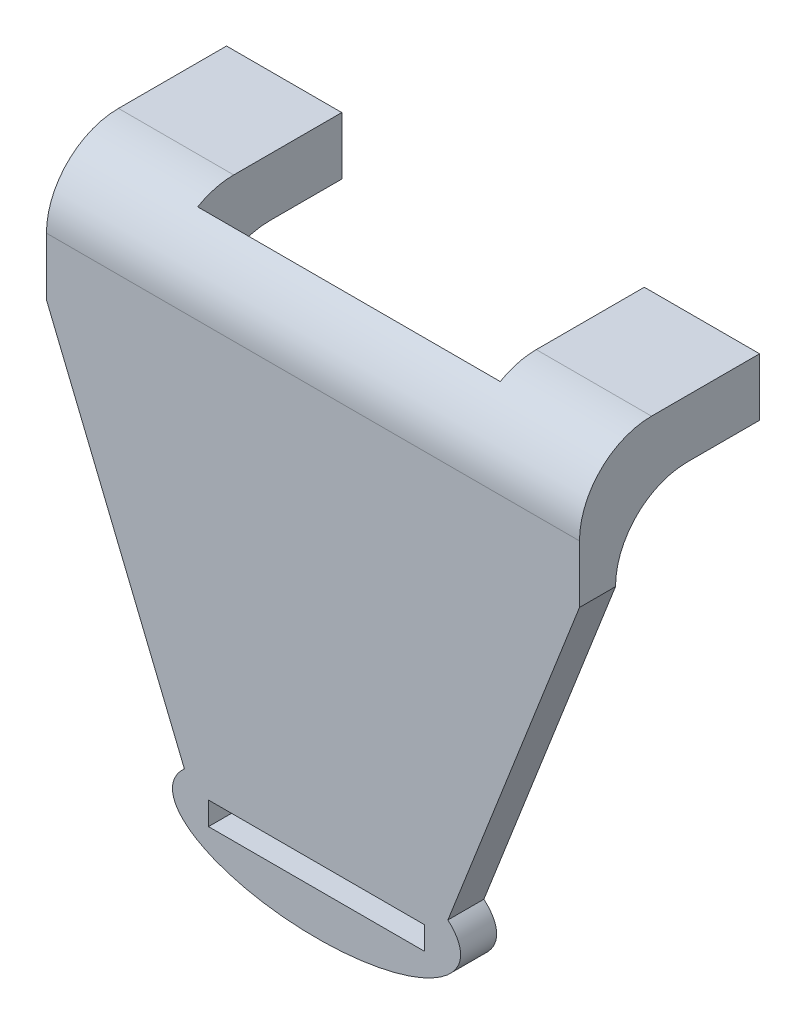
ISO-10303-21;
HEADER;
FILE_DESCRIPTION(('STEP AP214'),'2;1');
FILE_NAME('part.step','',(''),(''),'','','');
FILE_SCHEMA(('AUTOMOTIVE_DESIGN { 1 0 10303 214 1 1 1 1 }'));
ENDSEC;
DATA;
#1=APPLICATION_CONTEXT('core data for automotive mechanical design processes');
#2=APPLICATION_PROTOCOL_DEFINITION('international standard','automotive_design',2000,#1);
#3=PRODUCT_CONTEXT('',#1,'mechanical');
#4=PRODUCT('Part','Part','',(#3));
#5=PRODUCT_RELATED_PRODUCT_CATEGORY('part','',(#4));
#6=PRODUCT_DEFINITION_FORMATION('','',#4);
#7=PRODUCT_DEFINITION_CONTEXT('part definition',#1,'design');
#8=PRODUCT_DEFINITION('design','',#6,#7);
#9=PRODUCT_DEFINITION_SHAPE('','',#8);
#10=(LENGTH_UNIT() NAMED_UNIT(*) SI_UNIT(.MILLI.,.METRE.));
#11=(NAMED_UNIT(*) PLANE_ANGLE_UNIT() SI_UNIT($,.RADIAN.));
#12=(NAMED_UNIT(*) SI_UNIT($,.STERADIAN.) SOLID_ANGLE_UNIT());
#13=UNCERTAINTY_MEASURE_WITH_UNIT(LENGTH_MEASURE(1.E-05),#10,'distance_accuracy_value','');
#14=(GEOMETRIC_REPRESENTATION_CONTEXT(3) GLOBAL_UNCERTAINTY_ASSIGNED_CONTEXT((#13)) GLOBAL_UNIT_ASSIGNED_CONTEXT((#10,
#11,#12)) REPRESENTATION_CONTEXT('',''));
#15=CARTESIAN_POINT('',(0.,0.,0.));
#16=DIRECTION('',(0.,0.,1.));
#17=DIRECTION('',(1.,0.,0.));
#18=AXIS2_PLACEMENT_3D('',#15,#16,#17);
#19=CARTESIAN_POINT('',(38.,10.,-20.));
#20=DIRECTION('',(0.,1.,0.));
#21=DIRECTION('',(-1.,0.,0.));
#22=AXIS2_PLACEMENT_3D('',#19,#20,#21);
#23=PLANE('',#22);
#24=DIRECTION('',(0.,0.,1.));
#25=VECTOR('',#24,1.);
#26=CARTESIAN_POINT('',(38.,10.,-20.));
#27=LINE('',#26,#25);
#28=CARTESIAN_POINT('',(38.,10.,-20.));
#29=VERTEX_POINT('',#28);
#30=CARTESIAN_POINT('',(38.,10.,-10.));
#31=VERTEX_POINT('',#30);
#32=EDGE_CURVE('E347',#29,#31,#27,.T.);
#33=ORIENTED_EDGE('',*,*,#32,.T.);
#34=DIRECTION('',(-1.,0.,0.));
#35=VECTOR('',#34,1.);
#36=CARTESIAN_POINT('',(22.,10.,-10.));
#37=LINE('',#36,#35);
#38=CARTESIAN_POINT('',(34.,10.,-10.));
#39=VERTEX_POINT('',#38);
#40=EDGE_CURVE('E498',#31,#39,#37,.T.);
#41=ORIENTED_EDGE('',*,*,#40,.T.);
#42=DIRECTION('',(0.,0.,-1.));
#43=VECTOR('',#42,1.);
#44=CARTESIAN_POINT('',(34.,10.,-20.));
#45=LINE('',#44,#43);
#46=CARTESIAN_POINT('',(34.,10.,-20.));
#47=VERTEX_POINT('',#46);
#48=EDGE_CURVE('E285',#39,#47,#45,.T.);
#49=ORIENTED_EDGE('',*,*,#48,.T.);
#50=DIRECTION('',(-1.,0.,0.));
#51=VECTOR('',#50,1.);
#52=CARTESIAN_POINT('',(38.,10.,-20.));
#53=LINE('',#52,#51);
#54=EDGE_CURVE('E331',#29,#47,#53,.T.);
#55=ORIENTED_EDGE('',*,*,#54,.F.);
#56=EDGE_LOOP('',(#33,#41,#49,#55));
#57=FACE_BOUND('',#56,.T.);
#58=ADVANCED_FACE('F39',(#57),#23,.F.);
#59=CARTESIAN_POINT('',(-36.,10.,-20.));
#60=DIRECTION('',(0.,-1.,0.));
#61=DIRECTION('',(1.,0.,0.));
#62=AXIS2_PLACEMENT_3D('',#59,#60,#61);
#63=PLANE('',#62);
#64=DIRECTION('',(0.,0.,1.));
#65=VECTOR('',#64,1.);
#66=CARTESIAN_POINT('',(-20.,10.,-20.));
#67=LINE('',#66,#65);
#68=CARTESIAN_POINT('',(-20.,10.,-20.));
#69=VERTEX_POINT('',#68);
#70=CARTESIAN_POINT('',(-20.,10.,-10.));
#71=VERTEX_POINT('',#70);
#72=EDGE_CURVE('E322',#69,#71,#67,.T.);
#73=ORIENTED_EDGE('',*,*,#72,.T.);
#74=DIRECTION('',(1.,0.,0.));
#75=VECTOR('',#74,1.);
#76=CARTESIAN_POINT('',(-36.,10.,-10.));
#77=LINE('',#76,#75);
#78=CARTESIAN_POINT('',(-24.,10.,-10.));
#79=VERTEX_POINT('',#78);
#80=EDGE_CURVE('E583',#71,#79,#77,.F.);
#81=ORIENTED_EDGE('',*,*,#80,.T.);
#82=DIRECTION('',(0.,0.,-1.));
#83=VECTOR('',#82,1.);
#84=CARTESIAN_POINT('',(-24.,10.,-20.));
#85=LINE('',#84,#83);
#86=CARTESIAN_POINT('',(-24.,10.,-20.));
#87=VERTEX_POINT('',#86);
#88=EDGE_CURVE('E303',#79,#87,#85,.T.);
#89=ORIENTED_EDGE('',*,*,#88,.T.);
#90=DIRECTION('',(1.,0.,0.));
#91=VECTOR('',#90,1.);
#92=CARTESIAN_POINT('',(-36.,10.,-20.));
#93=LINE('',#92,#91);
#94=EDGE_CURVE('E256',#87,#69,#93,.T.);
#95=ORIENTED_EDGE('',*,*,#94,.T.);
#96=EDGE_LOOP('',(#73,#81,#89,#95));
#97=FACE_BOUND('',#96,.T.);
#98=ADVANCED_FACE('F463',(#97),#63,.T.);
#99=CARTESIAN_POINT('',(38.,18.,5.));
#100=DIRECTION('',(0.,-1.,0.));
#101=DIRECTION('',(1.,0.,0.));
#102=AXIS2_PLACEMENT_3D('',#99,#100,#101);
#103=PLANE('',#102);
#104=DIRECTION('',(0.,0.,-1.));
#105=VECTOR('',#104,1.);
#106=CARTESIAN_POINT('',(-36.,18.,5.));
#107=LINE('',#106,#105);
#108=CARTESIAN_POINT('',(-36.,18.,-5.));
#109=VERTEX_POINT('',#108);
#110=CARTESIAN_POINT('',(-36.,18.,-20.));
#111=VERTEX_POINT('',#110);
#112=EDGE_CURVE('E552',#109,#111,#107,.T.);
#113=ORIENTED_EDGE('',*,*,#112,.F.);
#114=DIRECTION('',(-1.,0.,0.));
#115=VECTOR('',#114,1.);
#116=CARTESIAN_POINT('',(38.,18.,-5.));
#117=LINE('',#116,#115);
#118=CARTESIAN_POINT('',(-20.,18.,-5.));
#119=VERTEX_POINT('',#118);
#120=EDGE_CURVE('E561',#109,#119,#117,.F.);
#121=ORIENTED_EDGE('',*,*,#120,.T.);
#122=DIRECTION('',(0.,0.,1.));
#123=VECTOR('',#122,1.);
#124=CARTESIAN_POINT('',(-20.,18.,-20.));
#125=LINE('',#124,#123);
#126=CARTESIAN_POINT('',(-20.,18.,-20.));
#127=VERTEX_POINT('',#126);
#128=EDGE_CURVE('E326',#127,#119,#125,.T.);
#129=ORIENTED_EDGE('',*,*,#128,.F.);
#130=DIRECTION('',(1.,0.,0.));
#131=VECTOR('',#130,1.);
#132=CARTESIAN_POINT('',(-36.,18.,-20.));
#133=LINE('',#132,#131);
#134=EDGE_CURVE('E307',#111,#127,#133,.T.);
#135=ORIENTED_EDGE('',*,*,#134,.F.);
#136=EDGE_LOOP('',(#113,#121,#129,#135));
#137=FACE_BOUND('',#136,.T.);
#138=ADVANCED_FACE('F443',(#137),#103,.F.);
#139=DIRECTION('',(0.,0.,1.));
#140=VECTOR('',#139,1.);
#141=CARTESIAN_POINT('',(26.,10.,-20.));
#142=LINE('',#141,#140);
#143=CARTESIAN_POINT('',(26.,10.,-20.));
#144=VERTEX_POINT('',#143);
#145=CARTESIAN_POINT('',(26.,10.,-10.));
#146=VERTEX_POINT('',#145);
#147=EDGE_CURVE('E275',#144,#146,#142,.T.);
#148=ORIENTED_EDGE('',*,*,#147,.T.);
#149=DIRECTION('',(-1.,0.,0.));
#150=VECTOR('',#149,1.);
#151=CARTESIAN_POINT('',(22.,10.,-10.));
#152=LINE('',#151,#150);
#153=CARTESIAN_POINT('',(22.,10.,-10.));
#154=VERTEX_POINT('',#153);
#155=EDGE_CURVE('E488',#146,#154,#152,.T.);
#156=ORIENTED_EDGE('',*,*,#155,.T.);
#157=DIRECTION('',(0.,0.,1.));
#158=VECTOR('',#157,1.);
#159=CARTESIAN_POINT('',(22.,10.,-20.));
#160=LINE('',#159,#158);
#161=CARTESIAN_POINT('',(22.,10.,-20.));
#162=VERTEX_POINT('',#161);
#163=EDGE_CURVE('E358',#162,#154,#160,.T.);
#164=ORIENTED_EDGE('',*,*,#163,.F.);
#165=EDGE_CURVE('E336',#144,#162,#53,.T.);
#166=ORIENTED_EDGE('',*,*,#165,.F.);
#167=EDGE_LOOP('',(#148,#156,#164,#166));
#168=FACE_BOUND('',#167,.T.);
#169=ADVANCED_FACE('F466',(#168),#23,.F.);
#170=CARTESIAN_POINT('',(0.,0.,-20.));
#171=DIRECTION('',(0.,0.,-1.));
#172=DIRECTION('',(-1.,0.,0.));
#173=AXIS2_PLACEMENT_3D('',#170,#171,#172);
#174=PLANE('',#173);
#175=ORIENTED_EDGE('',*,*,#54,.T.);
#176=DIRECTION('',(0.,-1.,0.));
#177=VECTOR('',#176,1.);
#178=CARTESIAN_POINT('',(34.,15.,-20.));
#179=LINE('',#178,#177);
#180=CARTESIAN_POINT('',(34.,15.,-20.));
#181=VERTEX_POINT('',#180);
#182=EDGE_CURVE('E299',#181,#47,#179,.T.);
#183=ORIENTED_EDGE('',*,*,#182,.F.);
#184=DIRECTION('',(-1.,0.,0.));
#185=VECTOR('',#184,1.);
#186=CARTESIAN_POINT('',(26.,15.,-20.));
#187=LINE('',#186,#185);
#188=CARTESIAN_POINT('',(26.,15.,-20.));
#189=VERTEX_POINT('',#188);
#190=EDGE_CURVE('E274',#181,#189,#187,.T.);
#191=ORIENTED_EDGE('',*,*,#190,.T.);
#192=DIRECTION('',(0.,-1.,0.));
#193=VECTOR('',#192,1.);
#194=CARTESIAN_POINT('',(26.,15.,-20.));
#195=LINE('',#194,#193);
#196=EDGE_CURVE('E295',#189,#144,#195,.T.);
#197=ORIENTED_EDGE('',*,*,#196,.T.);
#198=ORIENTED_EDGE('',*,*,#165,.T.);
#199=DIRECTION('',(0.,1.,0.));
#200=VECTOR('',#199,1.);
#201=CARTESIAN_POINT('',(22.,10.,-20.));
#202=LINE('',#201,#200);
#203=CARTESIAN_POINT('',(22.,18.,-20.));
#204=VERTEX_POINT('',#203);
#205=EDGE_CURVE('E335',#162,#204,#202,.T.);
#206=ORIENTED_EDGE('',*,*,#205,.T.);
#207=DIRECTION('',(-1.,0.,0.));
#208=VECTOR('',#207,1.);
#209=CARTESIAN_POINT('',(38.,18.,-20.));
#210=LINE('',#209,#208);
#211=CARTESIAN_POINT('',(38.,18.,-20.));
#212=VERTEX_POINT('',#211);
#213=EDGE_CURVE('E339',#212,#204,#210,.T.);
#214=ORIENTED_EDGE('',*,*,#213,.F.);
#215=DIRECTION('',(0.,1.,0.));
#216=VECTOR('',#215,1.);
#217=CARTESIAN_POINT('',(38.,10.,-20.));
#218=LINE('',#217,#216);
#219=EDGE_CURVE('E343',#29,#212,#218,.T.);
#220=ORIENTED_EDGE('',*,*,#219,.F.);
#221=EDGE_LOOP('',(#175,#183,#191,#197,#198,#206,#214,#220));
#222=FACE_BOUND('',#221,.T.);
#223=ADVANCED_FACE('F476',(#222),#174,.T.);
#224=DIRECTION('',(0.,0.,1.));
#225=VECTOR('',#224,1.);
#226=CARTESIAN_POINT('',(-32.,10.,-20.));
#227=LINE('',#226,#225);
#228=CARTESIAN_POINT('',(-32.,10.,-20.));
#229=VERTEX_POINT('',#228);
#230=CARTESIAN_POINT('',(-32.,10.,-10.));
#231=VERTEX_POINT('',#230);
#232=EDGE_CURVE('E252',#229,#231,#227,.T.);
#233=ORIENTED_EDGE('',*,*,#232,.T.);
#234=DIRECTION('',(1.,0.,0.));
#235=VECTOR('',#234,1.);
#236=CARTESIAN_POINT('',(-36.,10.,-10.));
#237=LINE('',#236,#235);
#238=CARTESIAN_POINT('',(-36.,10.,-10.));
#239=VERTEX_POINT('',#238);
#240=EDGE_CURVE('E580',#231,#239,#237,.F.);
#241=ORIENTED_EDGE('',*,*,#240,.T.);
#242=DIRECTION('',(0.,0.,1.));
#243=VECTOR('',#242,1.);
#244=CARTESIAN_POINT('',(-36.,10.,-20.));
#245=LINE('',#244,#243);
#246=CARTESIAN_POINT('',(-36.,10.,-20.));
#247=VERTEX_POINT('',#246);
#248=EDGE_CURVE('E317',#247,#239,#245,.T.);
#249=ORIENTED_EDGE('',*,*,#248,.F.);
#250=EDGE_CURVE('E314',#247,#229,#93,.T.);
#251=ORIENTED_EDGE('',*,*,#250,.T.);
#252=EDGE_LOOP('',(#233,#241,#249,#251));
#253=FACE_BOUND('',#252,.T.);
#254=ADVANCED_FACE('F472',(#253),#63,.T.);
#255=CARTESIAN_POINT('',(0.,0.,-20.));
#256=DIRECTION('',(0.,0.,-1.));
#257=DIRECTION('',(-1.,0.,0.));
#258=AXIS2_PLACEMENT_3D('',#255,#256,#257);
#259=PLANE('',#258);
#260=ORIENTED_EDGE('',*,*,#94,.F.);
#261=DIRECTION('',(0.,-1.,0.));
#262=VECTOR('',#261,1.);
#263=CARTESIAN_POINT('',(-24.,15.,-20.));
#264=LINE('',#263,#262);
#265=CARTESIAN_POINT('',(-24.,15.,-20.));
#266=VERTEX_POINT('',#265);
#267=EDGE_CURVE('E247',#266,#87,#264,.T.);
#268=ORIENTED_EDGE('',*,*,#267,.F.);
#269=DIRECTION('',(-1.,0.,0.));
#270=VECTOR('',#269,1.);
#271=CARTESIAN_POINT('',(-32.,15.,-20.));
#272=LINE('',#271,#270);
#273=CARTESIAN_POINT('',(-32.,15.,-20.));
#274=VERTEX_POINT('',#273);
#275=EDGE_CURVE('E230',#266,#274,#272,.T.);
#276=ORIENTED_EDGE('',*,*,#275,.T.);
#277=DIRECTION('',(0.,-1.,0.));
#278=VECTOR('',#277,1.);
#279=CARTESIAN_POINT('',(-32.,15.,-20.));
#280=LINE('',#279,#278);
#281=EDGE_CURVE('E259',#274,#229,#280,.T.);
#282=ORIENTED_EDGE('',*,*,#281,.T.);
#283=ORIENTED_EDGE('',*,*,#250,.F.);
#284=DIRECTION('',(0.,1.,0.));
#285=VECTOR('',#284,1.);
#286=CARTESIAN_POINT('',(-36.,10.,-20.));
#287=LINE('',#286,#285);
#288=EDGE_CURVE('E264',#247,#111,#287,.T.);
#289=ORIENTED_EDGE('',*,*,#288,.T.);
#290=ORIENTED_EDGE('',*,*,#134,.T.);
#291=DIRECTION('',(0.,1.,0.));
#292=VECTOR('',#291,1.);
#293=CARTESIAN_POINT('',(-20.,10.,-20.));
#294=LINE('',#293,#292);
#295=EDGE_CURVE('E310',#69,#127,#294,.T.);
#296=ORIENTED_EDGE('',*,*,#295,.F.);
#297=EDGE_LOOP('',(#260,#268,#276,#282,#283,#289,#290,#296));
#298=FACE_BOUND('',#297,.T.);
#299=ADVANCED_FACE('F254',(#298),#259,.T.);
#300=CARTESIAN_POINT('',(0.,0.,0.));
#301=DIRECTION('',(0.,0.,1.));
#302=DIRECTION('',(1.,0.,0.));
#303=AXIS2_PLACEMENT_3D('',#300,#301,#302);
#304=PLANE('',#303);
#305=DIRECTION('',(0.,1.,0.));
#306=VECTOR('',#305,1.);
#307=CARTESIAN_POINT('',(16.5,-48.9008766697435,0.));
#308=LINE('',#307,#306);
#309=CARTESIAN_POINT('',(16.5,-52.0991233302565,0.));
#310=VERTEX_POINT('',#309);
#311=CARTESIAN_POINT('',(16.5,-48.9008766697435,0.));
#312=VERTEX_POINT('',#311);
#313=EDGE_CURVE('E362',#310,#312,#308,.T.);
#314=ORIENTED_EDGE('',*,*,#313,.T.);
#315=DIRECTION('',(-1.,0.,0.));
#316=VECTOR('',#315,1.);
#317=CARTESIAN_POINT('',(-13.5,-48.9008766697435,0.));
#318=LINE('',#317,#316);
#319=CARTESIAN_POINT('',(-13.5,-48.9008766697435,0.));
#320=VERTEX_POINT('',#319);
#321=EDGE_CURVE('E381',#312,#320,#318,.T.);
#322=ORIENTED_EDGE('',*,*,#321,.T.);
#323=DIRECTION('',(0.,-1.,0.));
#324=VECTOR('',#323,1.);
#325=CARTESIAN_POINT('',(-13.5,-48.9008766697435,0.));
#326=LINE('',#325,#324);
#327=CARTESIAN_POINT('',(-13.5,-52.0991233302565,0.));
#328=VERTEX_POINT('',#327);
#329=EDGE_CURVE('E385',#320,#328,#326,.T.);
#330=ORIENTED_EDGE('',*,*,#329,.T.);
#331=DIRECTION('',(1.,0.,0.));
#332=VECTOR('',#331,1.);
#333=CARTESIAN_POINT('',(-13.5,-52.0991233302565,0.));
#334=LINE('',#333,#332);
#335=EDGE_CURVE('E367',#328,#310,#334,.T.);
#336=ORIENTED_EDGE('',*,*,#335,.T.);
#337=EDGE_LOOP('',(#314,#322,#330,#336));
#338=FACE_BOUND('',#337,.T.);
#339=DIRECTION('',(0.,1.,0.));
#340=VECTOR('',#339,1.);
#341=CARTESIAN_POINT('',(22.,10.,0.));
#342=LINE('',#341,#340);
#343=CARTESIAN_POINT('',(22.,0.,0.));
#344=VERTEX_POINT('',#343);
#345=CARTESIAN_POINT('',(22.,16.6602540378444,0.));
#346=VERTEX_POINT('',#345);
#347=EDGE_CURVE('E330',#344,#346,#342,.T.);
#348=ORIENTED_EDGE('',*,*,#347,.F.);
#349=DIRECTION('',(-1.,0.,0.));
#350=VECTOR('',#349,1.);
#351=CARTESIAN_POINT('',(38.,0.,0.));
#352=LINE('',#351,#350);
#353=CARTESIAN_POINT('',(38.,0.,0.));
#354=VERTEX_POINT('',#353);
#355=EDGE_CURVE('E504',#344,#354,#352,.F.);
#356=ORIENTED_EDGE('',*,*,#355,.T.);
#357=DIRECTION('',(0.364212990761324,0.931315680830454,0.));
#358=VECTOR('',#357,1.);
#359=CARTESIAN_POINT('',(18.4463192095855,-50.,0.));
#360=LINE('',#359,#358);
#361=CARTESIAN_POINT('',(19.7323077394399,-46.7116458951175,0.));
#362=VERTEX_POINT('',#361);
#363=EDGE_CURVE('E529',#362,#354,#360,.T.);
#364=ORIENTED_EDGE('',*,*,#363,.F.);
#365=CARTESIAN_POINT('',(1.5,-50.,0.));
#366=DIRECTION('',(0.,0.,1.));
#367=DIRECTION('',(1.,0.,0.));
#368=AXIS2_PLACEMENT_3D('',#365,#366,#367);
#369=ELLIPSE('',#368,20.,8.);
#370=CARTESIAN_POINT('',(-16.8535120376291,-46.8213563676409,0.));
#371=VERTEX_POINT('',#370);
#372=EDGE_CURVE('E405',#371,#362,#369,.T.);
#373=ORIENTED_EDGE('',*,*,#372,.F.);
#374=DIRECTION('',(0.378502389569488,-0.92560031389914,0.));
#375=VECTOR('',#374,1.);
#376=CARTESIAN_POINT('',(-36.,0.,0.));
#377=LINE('',#376,#375);
#378=CARTESIAN_POINT('',(-36.,0.,0.));
#379=VERTEX_POINT('',#378);
#380=EDGE_CURVE('E538',#379,#371,#377,.T.);
#381=ORIENTED_EDGE('',*,*,#380,.F.);
#382=DIRECTION('',(1.,0.,0.));
#383=VECTOR('',#382,1.);
#384=CARTESIAN_POINT('',(0.,0.,0.));
#385=LINE('',#384,#383);
#386=CARTESIAN_POINT('',(-20.,0.,0.));
#387=VERTEX_POINT('',#386);
#388=EDGE_CURVE('E576',#379,#387,#385,.T.);
#389=ORIENTED_EDGE('',*,*,#388,.T.);
#390=DIRECTION('',(0.,1.,0.));
#391=VECTOR('',#390,1.);
#392=CARTESIAN_POINT('',(-20.,10.,0.));
#393=LINE('',#392,#391);
#394=CARTESIAN_POINT('',(-20.,16.6602540378444,0.));
#395=VERTEX_POINT('',#394);
#396=EDGE_CURVE('E258',#387,#395,#393,.T.);
#397=ORIENTED_EDGE('',*,*,#396,.T.);
#398=DIRECTION('',(1.,0.,0.));
#399=VECTOR('',#398,1.);
#400=CARTESIAN_POINT('',(-20.,16.6602540378444,0.));
#401=LINE('',#400,#399);
#402=EDGE_CURVE('E567',#395,#346,#401,.T.);
#403=ORIENTED_EDGE('',*,*,#402,.T.);
#404=EDGE_LOOP('',(#348,#356,#364,#373,#381,#389,#397,#403));
#405=FACE_BOUND('',#404,.T.);
#406=ADVANCED_FACE('F426',(#338,#405),#304,.F.);
#407=CARTESIAN_POINT('',(0.,0.,5.));
#408=DIRECTION('',(0.,0.,1.));
#409=DIRECTION('',(1.,0.,0.));
#410=AXIS2_PLACEMENT_3D('',#407,#408,#409);
#411=PLANE('',#410);
#412=DIRECTION('',(0.,1.,0.));
#413=VECTOR('',#412,1.);
#414=CARTESIAN_POINT('',(38.,0.,5.));
#415=LINE('',#414,#413);
#416=CARTESIAN_POINT('',(38.,0.,5.));
#417=VERTEX_POINT('',#416);
#418=CARTESIAN_POINT('',(38.,8.00000000000001,5.));
#419=VERTEX_POINT('',#418);
#420=EDGE_CURVE('E542',#417,#419,#415,.T.);
#421=ORIENTED_EDGE('',*,*,#420,.T.);
#422=DIRECTION('',(-1.,0.,0.));
#423=VECTOR('',#422,1.);
#424=CARTESIAN_POINT('',(-36.,8.,5.));
#425=LINE('',#424,#423);
#426=CARTESIAN_POINT('',(-36.,8.,5.));
#427=VERTEX_POINT('',#426);
#428=EDGE_CURVE('E544',#419,#427,#425,.T.);
#429=ORIENTED_EDGE('',*,*,#428,.T.);
#430=DIRECTION('',(0.,-1.,0.));
#431=VECTOR('',#430,1.);
#432=CARTESIAN_POINT('',(-36.,18.,5.));
#433=LINE('',#432,#431);
#434=CARTESIAN_POINT('',(-36.,0.,5.));
#435=VERTEX_POINT('',#434);
#436=EDGE_CURVE('E675',#427,#435,#433,.T.);
#437=ORIENTED_EDGE('',*,*,#436,.T.);
#438=DIRECTION('',(0.378502389569488,-0.92560031389914,0.));
#439=VECTOR('',#438,1.);
#440=CARTESIAN_POINT('',(-36.,0.,5.));
#441=LINE('',#440,#439);
#442=CARTESIAN_POINT('',(-16.8535120376291,-46.8213563676409,5.));
#443=VERTEX_POINT('',#442);
#444=EDGE_CURVE('E619',#435,#443,#441,.T.);
#445=ORIENTED_EDGE('',*,*,#444,.T.);
#446=CARTESIAN_POINT('',(1.5,-50.,5.));
#447=DIRECTION('',(0.,0.,1.));
#448=DIRECTION('',(1.,0.,0.));
#449=AXIS2_PLACEMENT_3D('',#446,#447,#448);
#450=ELLIPSE('',#449,20.,8.);
#451=CARTESIAN_POINT('',(19.7323077394399,-46.7116458951175,5.));
#452=VERTEX_POINT('',#451);
#453=EDGE_CURVE('E406',#443,#452,#450,.T.);
#454=ORIENTED_EDGE('',*,*,#453,.T.);
#455=DIRECTION('',(0.364212990761324,0.931315680830454,0.));
#456=VECTOR('',#455,1.);
#457=CARTESIAN_POINT('',(18.4463192095855,-50.,5.));
#458=LINE('',#457,#456);
#459=EDGE_CURVE('E623',#452,#417,#458,.T.);
#460=ORIENTED_EDGE('',*,*,#459,.T.);
#461=EDGE_LOOP('',(#421,#429,#437,#445,#454,#460));
#462=FACE_BOUND('',#461,.T.);
#463=DIRECTION('',(-1.,0.,0.));
#464=VECTOR('',#463,1.);
#465=CARTESIAN_POINT('',(-13.5,-48.9008766697435,5.));
#466=LINE('',#465,#464);
#467=CARTESIAN_POINT('',(16.5,-48.9008766697435,5.));
#468=VERTEX_POINT('',#467);
#469=CARTESIAN_POINT('',(-13.5,-48.9008766697435,5.));
#470=VERTEX_POINT('',#469);
#471=EDGE_CURVE('E366',#468,#470,#466,.T.);
#472=ORIENTED_EDGE('',*,*,#471,.F.);
#473=DIRECTION('',(0.,1.,0.));
#474=VECTOR('',#473,1.);
#475=CARTESIAN_POINT('',(16.5,-48.9008766697435,5.));
#476=LINE('',#475,#474);
#477=CARTESIAN_POINT('',(16.5,-52.0991233302565,5.));
#478=VERTEX_POINT('',#477);
#479=EDGE_CURVE('E363',#478,#468,#476,.T.);
#480=ORIENTED_EDGE('',*,*,#479,.F.);
#481=DIRECTION('',(1.,0.,0.));
#482=VECTOR('',#481,1.);
#483=CARTESIAN_POINT('',(-13.5,-52.0991233302565,5.));
#484=LINE('',#483,#482);
#485=CARTESIAN_POINT('',(-13.5,-52.0991233302565,5.));
#486=VERTEX_POINT('',#485);
#487=EDGE_CURVE('E374',#486,#478,#484,.T.);
#488=ORIENTED_EDGE('',*,*,#487,.F.);
#489=DIRECTION('',(0.,-1.,0.));
#490=VECTOR('',#489,1.);
#491=CARTESIAN_POINT('',(-13.5,-48.9008766697435,5.));
#492=LINE('',#491,#490);
#493=EDGE_CURVE('E370',#470,#486,#492,.T.);
#494=ORIENTED_EDGE('',*,*,#493,.F.);
#495=EDGE_LOOP('',(#472,#480,#488,#494));
#496=FACE_BOUND('',#495,.T.);
#497=ADVANCED_FACE('F422',(#462,#496),#411,.T.);
#498=CARTESIAN_POINT('',(18.4463192095855,-50.,5.));
#499=DIRECTION('',(-0.931315680830454,0.364212990761324,0.));
#500=DIRECTION('',(-0.364212990761324,-0.931315680830454,0.));
#501=AXIS2_PLACEMENT_3D('',#498,#499,#500);
#502=PLANE('',#501);
#503=DIRECTION('',(0.,0.,-1.));
#504=VECTOR('',#503,1.);
#505=CARTESIAN_POINT('',(19.7323077394399,-46.7116458951175,5.));
#506=LINE('',#505,#504);
#507=EDGE_CURVE('E536',#362,#452,#506,.F.);
#508=ORIENTED_EDGE('',*,*,#507,.F.);
#509=ORIENTED_EDGE('',*,*,#363,.T.);
#510=DIRECTION('',(0.,0.,-1.));
#511=VECTOR('',#510,1.);
#512=CARTESIAN_POINT('',(38.,0.,5.));
#513=LINE('',#512,#511);
#514=EDGE_CURVE('E533',#417,#354,#513,.T.);
#515=ORIENTED_EDGE('',*,*,#514,.F.);
#516=ORIENTED_EDGE('',*,*,#459,.F.);
#517=EDGE_LOOP('',(#508,#509,#515,#516));
#518=FACE_BOUND('',#517,.T.);
#519=ADVANCED_FACE('F425',(#518),#502,.F.);
#520=CARTESIAN_POINT('',(-36.,0.,5.));
#521=DIRECTION('',(0.92560031389914,0.378502389569488,0.));
#522=DIRECTION('',(-0.378502389569488,0.92560031389914,0.));
#523=AXIS2_PLACEMENT_3D('',#520,#521,#522);
#524=PLANE('',#523);
#525=DIRECTION('',(0.,0.,-1.));
#526=VECTOR('',#525,1.);
#527=CARTESIAN_POINT('',(-16.8535120376291,-46.8213563676409,5.));
#528=LINE('',#527,#526);
#529=EDGE_CURVE('E411',#443,#371,#528,.T.);
#530=ORIENTED_EDGE('',*,*,#529,.F.);
#531=ORIENTED_EDGE('',*,*,#444,.F.);
#532=DIRECTION('',(0.,0.,-1.));
#533=VECTOR('',#532,1.);
#534=CARTESIAN_POINT('',(-36.,0.,5.));
#535=LINE('',#534,#533);
#536=EDGE_CURVE('E613',#435,#379,#535,.T.);
#537=ORIENTED_EDGE('',*,*,#536,.T.);
#538=ORIENTED_EDGE('',*,*,#380,.T.);
#539=EDGE_LOOP('',(#530,#531,#537,#538));
#540=FACE_BOUND('',#539,.T.);
#541=ADVANCED_FACE('F431',(#540),#524,.F.);
#542=CARTESIAN_POINT('',(38.,0.,5.));
#543=DIRECTION('',(-1.,0.,0.));
#544=DIRECTION('',(0.,0.,1.));
#545=AXIS2_PLACEMENT_3D('',#542,#543,#544);
#546=PLANE('',#545);
#547=DIRECTION('',(0.,0.,-1.));
#548=VECTOR('',#547,1.);
#549=CARTESIAN_POINT('',(38.,18.,5.));
#550=LINE('',#549,#548);
#551=CARTESIAN_POINT('',(38.,18.,-5.));
#552=VERTEX_POINT('',#551);
#553=EDGE_CURVE('E545',#552,#212,#550,.T.);
#554=ORIENTED_EDGE('',*,*,#553,.F.);
#555=CARTESIAN_POINT('',(38.,8.00000000000001,-5.));
#556=DIRECTION('',(-1.,0.,0.));
#557=DIRECTION('',(0.,0.,1.));
#558=AXIS2_PLACEMENT_3D('',#555,#556,#557);
#559=CIRCLE('',#558,10.);
#560=EDGE_CURVE('E573',#552,#419,#559,.F.);
#561=ORIENTED_EDGE('',*,*,#560,.T.);
#562=ORIENTED_EDGE('',*,*,#420,.F.);
#563=ORIENTED_EDGE('',*,*,#514,.T.);
#564=CARTESIAN_POINT('',(38.,0.,-10.));
#565=DIRECTION('',(-1.,0.,0.));
#566=DIRECTION('',(0.,0.,1.));
#567=AXIS2_PLACEMENT_3D('',#564,#565,#566);
#568=CIRCLE('',#567,10.);
#569=EDGE_CURVE('E11',#354,#31,#568,.T.);
#570=ORIENTED_EDGE('',*,*,#569,.T.);
#571=ORIENTED_EDGE('',*,*,#32,.F.);
#572=ORIENTED_EDGE('',*,*,#219,.T.);
#573=EDGE_LOOP('',(#554,#561,#562,#563,#570,#571,#572));
#574=FACE_BOUND('',#573,.T.);
#575=ADVANCED_FACE('F434',(#574),#546,.F.);
#576=DIRECTION('',(0.,0.,1.));
#577=VECTOR('',#576,1.);
#578=CARTESIAN_POINT('',(22.,18.,-20.));
#579=LINE('',#578,#577);
#580=CARTESIAN_POINT('',(22.,18.,-5.));
#581=VERTEX_POINT('',#580);
#582=EDGE_CURVE('E354',#204,#581,#579,.T.);
#583=ORIENTED_EDGE('',*,*,#582,.T.);
#584=DIRECTION('',(-1.,0.,0.));
#585=VECTOR('',#584,1.);
#586=CARTESIAN_POINT('',(38.,18.,-5.));
#587=LINE('',#586,#585);
#588=EDGE_CURVE('E558',#581,#552,#587,.F.);
#589=ORIENTED_EDGE('',*,*,#588,.T.);
#590=ORIENTED_EDGE('',*,*,#553,.T.);
#591=ORIENTED_EDGE('',*,*,#213,.T.);
#592=EDGE_LOOP('',(#583,#589,#590,#591));
#593=FACE_BOUND('',#592,.T.);
#594=ADVANCED_FACE('F438',(#593),#103,.F.);
#595=CARTESIAN_POINT('',(-36.,18.,5.));
#596=DIRECTION('',(1.,0.,0.));
#597=DIRECTION('',(0.,0.,-1.));
#598=AXIS2_PLACEMENT_3D('',#595,#596,#597);
#599=PLANE('',#598);
#600=ORIENTED_EDGE('',*,*,#436,.F.);
#601=CARTESIAN_POINT('',(-36.,8.,-5.));
#602=DIRECTION('',(1.,0.,0.));
#603=DIRECTION('',(0.,0.,-1.));
#604=AXIS2_PLACEMENT_3D('',#601,#602,#603);
#605=CIRCLE('',#604,10.);
#606=EDGE_CURVE('E550',#427,#109,#605,.F.);
#607=ORIENTED_EDGE('',*,*,#606,.T.);
#608=ORIENTED_EDGE('',*,*,#112,.T.);
#609=ORIENTED_EDGE('',*,*,#288,.F.);
#610=ORIENTED_EDGE('',*,*,#248,.T.);
#611=CARTESIAN_POINT('',(-36.,0.,-10.));
#612=DIRECTION('',(1.,0.,0.));
#613=DIRECTION('',(0.,0.,-1.));
#614=AXIS2_PLACEMENT_3D('',#611,#612,#613);
#615=CIRCLE('',#614,10.);
#616=EDGE_CURVE('E499',#239,#379,#615,.T.);
#617=ORIENTED_EDGE('',*,*,#616,.T.);
#618=ORIENTED_EDGE('',*,*,#536,.F.);
#619=EDGE_LOOP('',(#600,#607,#608,#609,#610,#617,#618));
#620=FACE_BOUND('',#619,.T.);
#621=ADVANCED_FACE('F419',(#620),#599,.F.);
#622=DIRECTION('',(0.,0.,-1.));
#623=VECTOR('',#622,1.);
#624=SURFACE_OF_LINEAR_EXTRUSION('',#450,#623);
#625=ORIENTED_EDGE('',*,*,#372,.T.);
#626=ORIENTED_EDGE('',*,*,#507,.T.);
#627=ORIENTED_EDGE('',*,*,#453,.F.);
#628=ORIENTED_EDGE('',*,*,#529,.T.);
#629=EDGE_LOOP('',(#625,#626,#627,#628));
#630=FACE_BOUND('',#629,.T.);
#631=ADVANCED_FACE('F414',(#630),#624,.F.);
#632=CARTESIAN_POINT('',(16.5,-48.9008766697435,5.));
#633=DIRECTION('',(-1.,0.,0.));
#634=DIRECTION('',(0.,0.,1.));
#635=AXIS2_PLACEMENT_3D('',#632,#633,#634);
#636=PLANE('',#635);
#637=ORIENTED_EDGE('',*,*,#313,.F.);
#638=DIRECTION('',(0.,0.,-1.));
#639=VECTOR('',#638,1.);
#640=CARTESIAN_POINT('',(16.5,-52.0991233302565,5.));
#641=LINE('',#640,#639);
#642=EDGE_CURVE('E377',#478,#310,#641,.T.);
#643=ORIENTED_EDGE('',*,*,#642,.F.);
#644=ORIENTED_EDGE('',*,*,#479,.T.);
#645=DIRECTION('',(0.,0.,-1.));
#646=VECTOR('',#645,1.);
#647=CARTESIAN_POINT('',(16.5,-48.9008766697435,5.));
#648=LINE('',#647,#646);
#649=EDGE_CURVE('E401',#468,#312,#648,.T.);
#650=ORIENTED_EDGE('',*,*,#649,.T.);
#651=EDGE_LOOP('',(#637,#643,#644,#650));
#652=FACE_BOUND('',#651,.T.);
#653=ADVANCED_FACE('F418',(#652),#636,.T.);
#654=CARTESIAN_POINT('',(-13.5,-48.9008766697435,5.));
#655=DIRECTION('',(0.,-1.,0.));
#656=DIRECTION('',(0.,0.,-1.));
#657=AXIS2_PLACEMENT_3D('',#654,#655,#656);
#658=PLANE('',#657);
#659=ORIENTED_EDGE('',*,*,#321,.F.);
#660=ORIENTED_EDGE('',*,*,#649,.F.);
#661=ORIENTED_EDGE('',*,*,#471,.T.);
#662=DIRECTION('',(0.,0.,-1.));
#663=VECTOR('',#662,1.);
#664=CARTESIAN_POINT('',(-13.5,-48.9008766697435,5.));
#665=LINE('',#664,#663);
#666=EDGE_CURVE('E398',#470,#320,#665,.T.);
#667=ORIENTED_EDGE('',*,*,#666,.T.);
#668=EDGE_LOOP('',(#659,#660,#661,#667));
#669=FACE_BOUND('',#668,.T.);
#670=ADVANCED_FACE('F687',(#669),#658,.T.);
#671=CARTESIAN_POINT('',(-13.5,-48.9008766697435,5.));
#672=DIRECTION('',(1.,0.,0.));
#673=DIRECTION('',(0.,0.,-1.));
#674=AXIS2_PLACEMENT_3D('',#671,#672,#673);
#675=PLANE('',#674);
#676=ORIENTED_EDGE('',*,*,#329,.F.);
#677=ORIENTED_EDGE('',*,*,#666,.F.);
#678=ORIENTED_EDGE('',*,*,#493,.T.);
#679=DIRECTION('',(0.,0.,-1.));
#680=VECTOR('',#679,1.);
#681=CARTESIAN_POINT('',(-13.5,-52.0991233302565,5.));
#682=LINE('',#681,#680);
#683=EDGE_CURVE('E395',#486,#328,#682,.T.);
#684=ORIENTED_EDGE('',*,*,#683,.T.);
#685=EDGE_LOOP('',(#676,#677,#678,#684));
#686=FACE_BOUND('',#685,.T.);
#687=ADVANCED_FACE('F690',(#686),#675,.T.);
#688=CARTESIAN_POINT('',(-13.5,-52.0991233302565,5.));
#689=DIRECTION('',(0.,1.,0.));
#690=DIRECTION('',(0.,0.,1.));
#691=AXIS2_PLACEMENT_3D('',#688,#689,#690);
#692=PLANE('',#691);
#693=ORIENTED_EDGE('',*,*,#335,.F.);
#694=ORIENTED_EDGE('',*,*,#683,.F.);
#695=ORIENTED_EDGE('',*,*,#487,.T.);
#696=ORIENTED_EDGE('',*,*,#642,.T.);
#697=EDGE_LOOP('',(#693,#694,#695,#696));
#698=FACE_BOUND('',#697,.T.);
#699=ADVANCED_FACE('F695',(#698),#692,.T.);
#700=CARTESIAN_POINT('',(22.,10.,-20.));
#701=DIRECTION('',(1.,0.,0.));
#702=DIRECTION('',(0.,1.,0.));
#703=AXIS2_PLACEMENT_3D('',#700,#701,#702);
#704=PLANE('',#703);
#705=ORIENTED_EDGE('',*,*,#347,.T.);
#706=CARTESIAN_POINT('',(22.,8.00000000000001,-5.));
#707=DIRECTION('',(1.,0.,0.));
#708=DIRECTION('',(0.,1.,0.));
#709=AXIS2_PLACEMENT_3D('',#706,#707,#708);
#710=CIRCLE('',#709,10.);
#711=EDGE_CURVE('E570',#346,#581,#710,.F.);
#712=ORIENTED_EDGE('',*,*,#711,.T.);
#713=ORIENTED_EDGE('',*,*,#582,.F.);
#714=ORIENTED_EDGE('',*,*,#205,.F.);
#715=ORIENTED_EDGE('',*,*,#163,.T.);
#716=CARTESIAN_POINT('',(22.,0.,-10.));
#717=DIRECTION('',(1.,0.,0.));
#718=DIRECTION('',(0.,1.,0.));
#719=AXIS2_PLACEMENT_3D('',#716,#717,#718);
#720=CIRCLE('',#719,10.);
#721=EDGE_CURVE('E48',#154,#344,#720,.T.);
#722=ORIENTED_EDGE('',*,*,#721,.T.);
#723=EDGE_LOOP('',(#705,#712,#713,#714,#715,#722));
#724=FACE_BOUND('',#723,.T.);
#725=ADVANCED_FACE('F521',(#724),#704,.F.);
#726=CARTESIAN_POINT('',(-20.,10.,-20.));
#727=DIRECTION('',(1.,0.,0.));
#728=DIRECTION('',(0.,1.,0.));
#729=AXIS2_PLACEMENT_3D('',#726,#727,#728);
#730=PLANE('',#729);
#731=ORIENTED_EDGE('',*,*,#128,.T.);
#732=CARTESIAN_POINT('',(-20.,8.,-5.));
#733=DIRECTION('',(1.,0.,0.));
#734=DIRECTION('',(0.,1.,0.));
#735=AXIS2_PLACEMENT_3D('',#732,#733,#734);
#736=CIRCLE('',#735,10.);
#737=EDGE_CURVE('E564',#119,#395,#736,.T.);
#738=ORIENTED_EDGE('',*,*,#737,.T.);
#739=ORIENTED_EDGE('',*,*,#396,.F.);
#740=CARTESIAN_POINT('',(-20.,0.,-10.));
#741=DIRECTION('',(1.,0.,0.));
#742=DIRECTION('',(0.,1.,0.));
#743=AXIS2_PLACEMENT_3D('',#740,#741,#742);
#744=CIRCLE('',#743,10.);
#745=EDGE_CURVE('E586',#387,#71,#744,.F.);
#746=ORIENTED_EDGE('',*,*,#745,.T.);
#747=ORIENTED_EDGE('',*,*,#72,.F.);
#748=ORIENTED_EDGE('',*,*,#295,.T.);
#749=EDGE_LOOP('',(#731,#738,#739,#746,#747,#748));
#750=FACE_BOUND('',#749,.T.);
#751=ADVANCED_FACE('F648',(#750),#730,.T.);
#752=CARTESIAN_POINT('',(-24.,15.,-20.));
#753=DIRECTION('',(-1.,0.,0.));
#754=DIRECTION('',(0.,0.,1.));
#755=AXIS2_PLACEMENT_3D('',#752,#753,#754);
#756=PLANE('',#755);
#757=ORIENTED_EDGE('',*,*,#88,.F.);
#758=CARTESIAN_POINT('',(-24.,0.,-10.));
#759=DIRECTION('',(-1.,0.,0.));
#760=DIRECTION('',(0.,0.,1.));
#761=AXIS2_PLACEMENT_3D('',#758,#759,#760);
#762=CIRCLE('',#761,10.);
#763=CARTESIAN_POINT('',(-24.,8.66025403784438,-5.));
#764=VERTEX_POINT('',#763);
#765=EDGE_CURVE('E589',#79,#764,#762,.F.);
#766=ORIENTED_EDGE('',*,*,#765,.T.);
#767=DIRECTION('',(0.,-1.,0.));
#768=VECTOR('',#767,1.);
#769=CARTESIAN_POINT('',(-24.,15.,-5.));
#770=LINE('',#769,#768);
#771=CARTESIAN_POINT('',(-24.,15.,-5.));
#772=VERTEX_POINT('',#771);
#773=EDGE_CURVE('E250',#772,#764,#770,.T.);
#774=ORIENTED_EDGE('',*,*,#773,.F.);
#775=DIRECTION('',(0.,0.,-1.));
#776=VECTOR('',#775,1.);
#777=CARTESIAN_POINT('',(-24.,15.,-20.));
#778=LINE('',#777,#776);
#779=EDGE_CURVE('E234',#772,#266,#778,.T.);
#780=ORIENTED_EDGE('',*,*,#779,.T.);
#781=ORIENTED_EDGE('',*,*,#267,.T.);
#782=EDGE_LOOP('',(#757,#766,#774,#780,#781));
#783=FACE_BOUND('',#782,.T.);
#784=ADVANCED_FACE('F246',(#783),#756,.T.);
#785=CARTESIAN_POINT('',(-32.,15.,-20.));
#786=DIRECTION('',(1.,0.,0.));
#787=DIRECTION('',(0.,0.,-1.));
#788=AXIS2_PLACEMENT_3D('',#785,#786,#787);
#789=PLANE('',#788);
#790=ORIENTED_EDGE('',*,*,#232,.F.);
#791=ORIENTED_EDGE('',*,*,#281,.F.);
#792=DIRECTION('',(0.,0.,1.));
#793=VECTOR('',#792,1.);
#794=CARTESIAN_POINT('',(-32.,15.,-20.));
#795=LINE('',#794,#793);
#796=CARTESIAN_POINT('',(-32.,15.,-5.));
#797=VERTEX_POINT('',#796);
#798=EDGE_CURVE('E235',#274,#797,#795,.T.);
#799=ORIENTED_EDGE('',*,*,#798,.T.);
#800=DIRECTION('',(0.,-1.,0.));
#801=VECTOR('',#800,1.);
#802=CARTESIAN_POINT('',(-32.,15.,-5.));
#803=LINE('',#802,#801);
#804=CARTESIAN_POINT('',(-32.,8.66025403784438,-5.));
#805=VERTEX_POINT('',#804);
#806=EDGE_CURVE('E266',#797,#805,#803,.T.);
#807=ORIENTED_EDGE('',*,*,#806,.T.);
#808=CARTESIAN_POINT('',(-32.,0.,-10.));
#809=DIRECTION('',(1.,0.,0.));
#810=DIRECTION('',(0.,0.,-1.));
#811=AXIS2_PLACEMENT_3D('',#808,#809,#810);
#812=CIRCLE('',#811,10.);
#813=EDGE_CURVE('E506',#805,#231,#812,.F.);
#814=ORIENTED_EDGE('',*,*,#813,.T.);
#815=EDGE_LOOP('',(#790,#791,#799,#807,#814));
#816=FACE_BOUND('',#815,.T.);
#817=ADVANCED_FACE('F599',(#816),#789,.T.);
#818=CARTESIAN_POINT('',(-32.,15.,-5.));
#819=DIRECTION('',(0.,0.,-1.));
#820=DIRECTION('',(-1.,0.,0.));
#821=AXIS2_PLACEMENT_3D('',#818,#819,#820);
#822=PLANE('',#821);
#823=ORIENTED_EDGE('',*,*,#773,.T.);
#824=DIRECTION('',(1.,0.,0.));
#825=VECTOR('',#824,1.);
#826=CARTESIAN_POINT('',(-24.,8.66025403784438,-5.));
#827=LINE('',#826,#825);
#828=EDGE_CURVE('E592',#764,#805,#827,.F.);
#829=ORIENTED_EDGE('',*,*,#828,.T.);
#830=ORIENTED_EDGE('',*,*,#806,.F.);
#831=DIRECTION('',(1.,0.,0.));
#832=VECTOR('',#831,1.);
#833=CARTESIAN_POINT('',(-32.,15.,-5.));
#834=LINE('',#833,#832);
#835=EDGE_CURVE('E634',#797,#772,#834,.T.);
#836=ORIENTED_EDGE('',*,*,#835,.T.);
#837=EDGE_LOOP('',(#823,#829,#830,#836));
#838=FACE_BOUND('',#837,.T.);
#839=ADVANCED_FACE('F637',(#838),#822,.T.);
#840=CARTESIAN_POINT('',(0.,15.,0.));
#841=DIRECTION('',(0.,1.,0.));
#842=DIRECTION('',(0.,0.,1.));
#843=AXIS2_PLACEMENT_3D('',#840,#841,#842);
#844=PLANE('',#843);
#845=ORIENTED_EDGE('',*,*,#779,.F.);
#846=ORIENTED_EDGE('',*,*,#835,.F.);
#847=ORIENTED_EDGE('',*,*,#798,.F.);
#848=ORIENTED_EDGE('',*,*,#275,.F.);
#849=EDGE_LOOP('',(#845,#846,#847,#848));
#850=FACE_BOUND('',#849,.T.);
#851=ADVANCED_FACE('F232',(#850),#844,.F.);
#852=CARTESIAN_POINT('',(34.,15.,-20.));
#853=DIRECTION('',(-1.,0.,0.));
#854=DIRECTION('',(0.,0.,1.));
#855=AXIS2_PLACEMENT_3D('',#852,#853,#854);
#856=PLANE('',#855);
#857=ORIENTED_EDGE('',*,*,#48,.F.);
#858=CARTESIAN_POINT('',(34.,0.,-10.));
#859=DIRECTION('',(-1.,0.,0.));
#860=DIRECTION('',(0.,0.,1.));
#861=AXIS2_PLACEMENT_3D('',#858,#859,#860);
#862=CIRCLE('',#861,10.);
#863=CARTESIAN_POINT('',(34.,8.66025403784439,-5.));
#864=VERTEX_POINT('',#863);
#865=EDGE_CURVE('E512',#39,#864,#862,.F.);
#866=ORIENTED_EDGE('',*,*,#865,.T.);
#867=DIRECTION('',(0.,-1.,0.));
#868=VECTOR('',#867,1.);
#869=CARTESIAN_POINT('',(34.,15.,-5.));
#870=LINE('',#869,#868);
#871=CARTESIAN_POINT('',(34.,15.,-5.));
#872=VERTEX_POINT('',#871);
#873=EDGE_CURVE('E62',#872,#864,#870,.T.);
#874=ORIENTED_EDGE('',*,*,#873,.F.);
#875=DIRECTION('',(0.,0.,-1.));
#876=VECTOR('',#875,1.);
#877=CARTESIAN_POINT('',(34.,15.,-20.));
#878=LINE('',#877,#876);
#879=EDGE_CURVE('E270',#872,#181,#878,.T.);
#880=ORIENTED_EDGE('',*,*,#879,.T.);
#881=ORIENTED_EDGE('',*,*,#182,.T.);
#882=EDGE_LOOP('',(#857,#866,#874,#880,#881));
#883=FACE_BOUND('',#882,.T.);
#884=ADVANCED_FACE('F660',(#883),#856,.T.);
#885=CARTESIAN_POINT('',(26.,15.,-20.));
#886=DIRECTION('',(1.,0.,0.));
#887=DIRECTION('',(0.,0.,-1.));
#888=AXIS2_PLACEMENT_3D('',#885,#886,#887);
#889=PLANE('',#888);
#890=ORIENTED_EDGE('',*,*,#147,.F.);
#891=ORIENTED_EDGE('',*,*,#196,.F.);
#892=DIRECTION('',(0.,0.,1.));
#893=VECTOR('',#892,1.);
#894=CARTESIAN_POINT('',(26.,15.,-20.));
#895=LINE('',#894,#893);
#896=CARTESIAN_POINT('',(26.,15.,-5.));
#897=VERTEX_POINT('',#896);
#898=EDGE_CURVE('E279',#189,#897,#895,.T.);
#899=ORIENTED_EDGE('',*,*,#898,.T.);
#900=DIRECTION('',(0.,-1.,0.));
#901=VECTOR('',#900,1.);
#902=CARTESIAN_POINT('',(26.,15.,-5.));
#903=LINE('',#902,#901);
#904=CARTESIAN_POINT('',(26.,8.66025403784439,-5.));
#905=VERTEX_POINT('',#904);
#906=EDGE_CURVE('E55',#897,#905,#903,.T.);
#907=ORIENTED_EDGE('',*,*,#906,.T.);
#908=CARTESIAN_POINT('',(26.,0.,-10.));
#909=DIRECTION('',(1.,0.,0.));
#910=DIRECTION('',(0.,0.,-1.));
#911=AXIS2_PLACEMENT_3D('',#908,#909,#910);
#912=CIRCLE('',#911,10.);
#913=EDGE_CURVE('E494',#905,#146,#912,.F.);
#914=ORIENTED_EDGE('',*,*,#913,.T.);
#915=EDGE_LOOP('',(#890,#891,#899,#907,#914));
#916=FACE_BOUND('',#915,.T.);
#917=ADVANCED_FACE('F664',(#916),#889,.T.);
#918=CARTESIAN_POINT('',(26.,15.,-5.));
#919=DIRECTION('',(0.,0.,-1.));
#920=DIRECTION('',(-1.,0.,0.));
#921=AXIS2_PLACEMENT_3D('',#918,#919,#920);
#922=PLANE('',#921);
#923=ORIENTED_EDGE('',*,*,#873,.T.);
#924=DIRECTION('',(1.,0.,0.));
#925=VECTOR('',#924,1.);
#926=CARTESIAN_POINT('',(34.,8.66025403784439,-5.));
#927=LINE('',#926,#925);
#928=EDGE_CURVE('E515',#864,#905,#927,.F.);
#929=ORIENTED_EDGE('',*,*,#928,.T.);
#930=ORIENTED_EDGE('',*,*,#906,.F.);
#931=DIRECTION('',(1.,0.,0.));
#932=VECTOR('',#931,1.);
#933=CARTESIAN_POINT('',(26.,15.,-5.));
#934=LINE('',#933,#932);
#935=EDGE_CURVE('E282',#897,#872,#934,.T.);
#936=ORIENTED_EDGE('',*,*,#935,.T.);
#937=EDGE_LOOP('',(#923,#929,#930,#936));
#938=FACE_BOUND('',#937,.T.);
#939=ADVANCED_FACE('F838',(#938),#922,.T.);
#940=CARTESIAN_POINT('',(0.,15.,0.));
#941=DIRECTION('',(0.,1.,0.));
#942=DIRECTION('',(0.,0.,1.));
#943=AXIS2_PLACEMENT_3D('',#940,#941,#942);
#944=PLANE('',#943);
#945=ORIENTED_EDGE('',*,*,#879,.F.);
#946=ORIENTED_EDGE('',*,*,#935,.F.);
#947=ORIENTED_EDGE('',*,*,#898,.F.);
#948=ORIENTED_EDGE('',*,*,#190,.F.);
#949=EDGE_LOOP('',(#945,#946,#947,#948));
#950=FACE_BOUND('',#949,.T.);
#951=ADVANCED_FACE('F453',(#950),#944,.F.);
#952=CARTESIAN_POINT('',(0.,8.00000000000001,-5.));
#953=DIRECTION('',(1.,0.,0.));
#954=DIRECTION('',(0.,1.,0.));
#955=AXIS2_PLACEMENT_3D('',#952,#953,#954);
#956=CYLINDRICAL_SURFACE('',#955,10.);
#957=ORIENTED_EDGE('',*,*,#737,.F.);
#958=ORIENTED_EDGE('',*,*,#120,.F.);
#959=ORIENTED_EDGE('',*,*,#606,.F.);
#960=ORIENTED_EDGE('',*,*,#428,.F.);
#961=ORIENTED_EDGE('',*,*,#560,.F.);
#962=ORIENTED_EDGE('',*,*,#588,.F.);
#963=ORIENTED_EDGE('',*,*,#711,.F.);
#964=ORIENTED_EDGE('',*,*,#402,.F.);
#965=EDGE_LOOP('',(#957,#958,#959,#960,#961,#962,#963,#964));
#966=FACE_BOUND('',#965,.T.);
#967=ADVANCED_FACE('F450',(#966),#956,.T.);
#968=CARTESIAN_POINT('',(0.,0.,-10.));
#969=DIRECTION('',(1.,0.,0.));
#970=DIRECTION('',(0.,1.,0.));
#971=AXIS2_PLACEMENT_3D('',#968,#969,#970);
#972=CYLINDRICAL_SURFACE('',#971,10.);
#973=ORIENTED_EDGE('',*,*,#765,.F.);
#974=ORIENTED_EDGE('',*,*,#80,.F.);
#975=ORIENTED_EDGE('',*,*,#745,.F.);
#976=ORIENTED_EDGE('',*,*,#388,.F.);
#977=ORIENTED_EDGE('',*,*,#616,.F.);
#978=ORIENTED_EDGE('',*,*,#240,.F.);
#979=ORIENTED_EDGE('',*,*,#813,.F.);
#980=ORIENTED_EDGE('',*,*,#828,.F.);
#981=EDGE_LOOP('',(#973,#974,#975,#976,#977,#978,#979,#980));
#982=FACE_BOUND('',#981,.T.);
#983=ADVANCED_FACE('F452',(#982),#972,.F.);
#984=CARTESIAN_POINT('',(38.,0.,-10.));
#985=DIRECTION('',(1.,0.,0.));
#986=DIRECTION('',(0.,1.,0.));
#987=AXIS2_PLACEMENT_3D('',#984,#985,#986);
#988=CYLINDRICAL_SURFACE('',#987,10.);
#989=ORIENTED_EDGE('',*,*,#569,.F.);
#990=ORIENTED_EDGE('',*,*,#355,.F.);
#991=ORIENTED_EDGE('',*,*,#721,.F.);
#992=ORIENTED_EDGE('',*,*,#155,.F.);
#993=ORIENTED_EDGE('',*,*,#913,.F.);
#994=ORIENTED_EDGE('',*,*,#928,.F.);
#995=ORIENTED_EDGE('',*,*,#865,.F.);
#996=ORIENTED_EDGE('',*,*,#40,.F.);
#997=EDGE_LOOP('',(#989,#990,#991,#992,#993,#994,#995,#996));
#998=FACE_BOUND('',#997,.T.);
#999=ADVANCED_FACE('F41',(#998),#988,.F.);
#1000=CLOSED_SHELL('',(#58,#98,#138,#169,#223,#254,#299,#406,#497,#519,#541,#575,#594,#621,#631,
#653,#670,#687,#699,#725,#751,#784,#817,#839,#851,#884,#917,#939,#951,#967,#983,#999));
#1001=MANIFOLD_SOLID_BREP('B2',#1000);
#1002=ADVANCED_BREP_SHAPE_REPRESENTATION('',(#18,#1001),#14);
#1003=SHAPE_DEFINITION_REPRESENTATION(#9,#1002);
ENDSEC;
END-ISO-10303-21;
